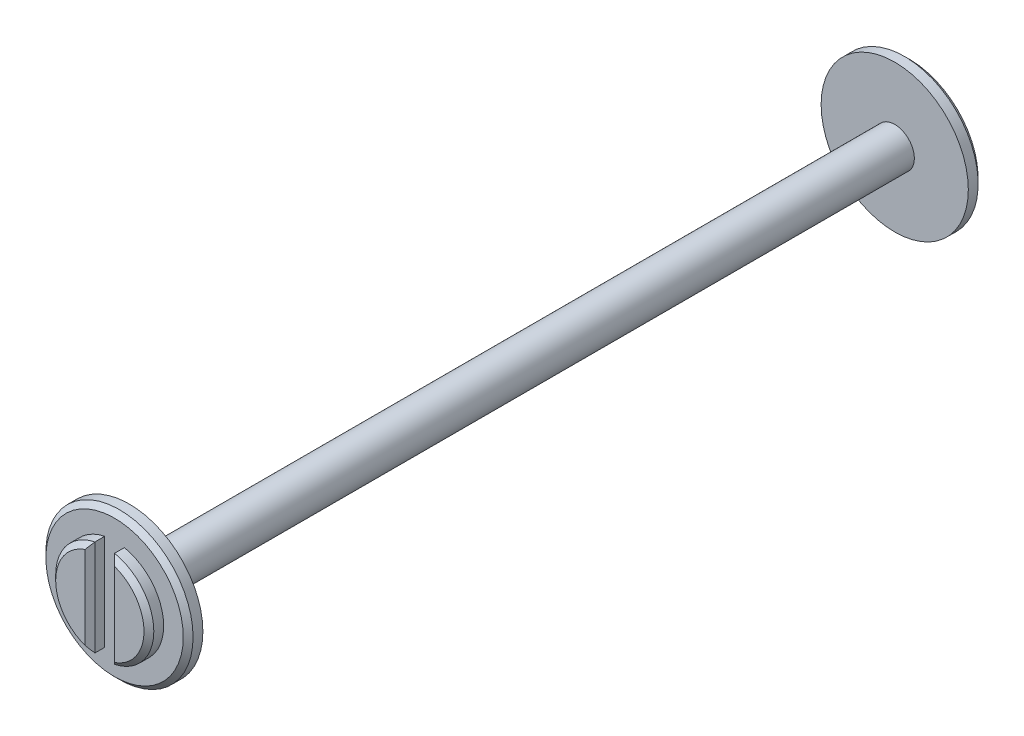
ISO-10303-21;
HEADER;
FILE_DESCRIPTION(('STEP AP214'),'2;1');
FILE_NAME('part.step','',(''),(''),'','','');
FILE_SCHEMA(('AUTOMOTIVE_DESIGN { 1 0 10303 214 1 1 1 1 }'));
ENDSEC;
DATA;
#1=APPLICATION_CONTEXT('core data for automotive mechanical design processes');
#2=APPLICATION_PROTOCOL_DEFINITION('international standard','automotive_design',2000,#1);
#3=PRODUCT_CONTEXT('',#1,'mechanical');
#4=PRODUCT('Part','Part','',(#3));
#5=PRODUCT_RELATED_PRODUCT_CATEGORY('part','',(#4));
#6=PRODUCT_DEFINITION_FORMATION('','',#4);
#7=PRODUCT_DEFINITION_CONTEXT('part definition',#1,'design');
#8=PRODUCT_DEFINITION('design','',#6,#7);
#9=PRODUCT_DEFINITION_SHAPE('','',#8);
#10=(LENGTH_UNIT() NAMED_UNIT(*) SI_UNIT(.MILLI.,.METRE.));
#11=(NAMED_UNIT(*) PLANE_ANGLE_UNIT() SI_UNIT($,.RADIAN.));
#12=(NAMED_UNIT(*) SI_UNIT($,.STERADIAN.) SOLID_ANGLE_UNIT());
#13=UNCERTAINTY_MEASURE_WITH_UNIT(LENGTH_MEASURE(1.E-05),#10,'distance_accuracy_value','');
#14=(GEOMETRIC_REPRESENTATION_CONTEXT(3) GLOBAL_UNCERTAINTY_ASSIGNED_CONTEXT((#13)) GLOBAL_UNIT_ASSIGNED_CONTEXT((#10,
#11,#12)) REPRESENTATION_CONTEXT('',''));
#15=CARTESIAN_POINT('',(0.,0.,0.));
#16=DIRECTION('',(0.,0.,1.));
#17=DIRECTION('',(1.,0.,0.));
#18=AXIS2_PLACEMENT_3D('',#15,#16,#17);
#19=CARTESIAN_POINT('',(0.,0.,3.));
#20=DIRECTION('',(0.,0.,-1.));
#21=DIRECTION('',(-1.,0.,0.));
#22=AXIS2_PLACEMENT_3D('',#19,#20,#21);
#23=CYLINDRICAL_SURFACE('',#22,5.);
#24=DIRECTION('',(0.,0.,-1.));
#25=VECTOR('',#24,1.);
#26=CARTESIAN_POINT('',(1.,4.89897948556636,3.));
#27=LINE('',#26,#25);
#28=CARTESIAN_POINT('',(1.,4.89897948556636,1.5));
#29=VERTEX_POINT('',#28);
#30=CARTESIAN_POINT('',(1.,4.89897948556636,2.49999999999999));
#31=VERTEX_POINT('',#30);
#32=EDGE_CURVE('E234',#29,#31,#27,.F.);
#33=ORIENTED_EDGE('',*,*,#32,.T.);
#34=CARTESIAN_POINT('',(0.,0.,2.49999999999999));
#35=DIRECTION('',(0.,0.,1.));
#36=DIRECTION('',(1.,0.,0.));
#37=AXIS2_PLACEMENT_3D('',#34,#35,#36);
#38=CIRCLE('',#37,5.);
#39=CARTESIAN_POINT('',(1.,-4.89897948556636,2.49999999999999));
#40=VERTEX_POINT('',#39);
#41=EDGE_CURVE('E299',#31,#40,#38,.F.);
#42=ORIENTED_EDGE('',*,*,#41,.T.);
#43=DIRECTION('',(0.,0.,-1.));
#44=VECTOR('',#43,1.);
#45=CARTESIAN_POINT('',(1.,-4.89897948556636,3.));
#46=LINE('',#45,#44);
#47=CARTESIAN_POINT('',(1.,-4.89897948556636,1.5));
#48=VERTEX_POINT('',#47);
#49=EDGE_CURVE('E237',#40,#48,#46,.T.);
#50=ORIENTED_EDGE('',*,*,#49,.T.);
#51=CARTESIAN_POINT('',(0.,0.,1.5));
#52=DIRECTION('',(0.,0.,1.));
#53=DIRECTION('',(1.,0.,0.));
#54=AXIS2_PLACEMENT_3D('',#51,#52,#53);
#55=CIRCLE('',#54,5.);
#56=EDGE_CURVE('E247',#48,#29,#55,.T.);
#57=ORIENTED_EDGE('',*,*,#56,.T.);
#58=EDGE_LOOP('',(#33,#42,#50,#57));
#59=FACE_BOUND('',#58,.T.);
#60=ADVANCED_FACE('F55',(#59),#23,.T.);
#61=CARTESIAN_POINT('',(0.,0.,3.));
#62=DIRECTION('',(0.,0.,1.));
#63=DIRECTION('',(1.,0.,0.));
#64=AXIS2_PLACEMENT_3D('',#61,#62,#63);
#65=PLANE('',#64);
#66=DIRECTION('',(0.,-1.,0.));
#67=VECTOR('',#66,1.);
#68=CARTESIAN_POINT('',(1.50000000000001,-4.89897948556636,3.));
#69=LINE('',#68,#67);
#70=CARTESIAN_POINT('',(1.50000000000001,4.24264068711927,3.));
#71=VERTEX_POINT('',#70);
#72=CARTESIAN_POINT('',(1.50000000000001,-4.24264068711927,3.));
#73=VERTEX_POINT('',#72);
#74=EDGE_CURVE('E292',#71,#73,#69,.T.);
#75=ORIENTED_EDGE('',*,*,#74,.T.);
#76=CARTESIAN_POINT('',(0.,0.,3.));
#77=DIRECTION('',(0.,0.,1.));
#78=DIRECTION('',(1.,0.,0.));
#79=AXIS2_PLACEMENT_3D('',#76,#77,#78);
#80=CIRCLE('',#79,4.49999999999999);
#81=EDGE_CURVE('E295',#73,#71,#80,.T.);
#82=ORIENTED_EDGE('',*,*,#81,.T.);
#83=EDGE_LOOP('',(#75,#82));
#84=FACE_BOUND('',#83,.T.);
#85=ADVANCED_FACE('F469',(#84),#65,.T.);
#86=CARTESIAN_POINT('',(0.,0.,1.5));
#87=DIRECTION('',(0.,0.,-1.));
#88=DIRECTION('',(-1.,0.,0.));
#89=AXIS2_PLACEMENT_3D('',#86,#87,#88);
#90=CYLINDRICAL_SURFACE('',#89,7.50000000000001);
#91=CARTESIAN_POINT('',(0.,0.,0.999999999999994));
#92=DIRECTION('',(0.,0.,1.));
#93=DIRECTION('',(1.,0.,0.));
#94=AXIS2_PLACEMENT_3D('',#91,#92,#93);
#95=CIRCLE('',#94,7.50000000000001);
#96=CARTESIAN_POINT('',(7.50000000000001,0.,0.999999999999994));
#97=VERTEX_POINT('',#96);
#98=EDGE_CURVE('E11',#97,#97,#95,.F.);
#99=ORIENTED_EDGE('',*,*,#98,.T.);
#100=EDGE_LOOP('',(#99));
#101=FACE_BOUND('',#100,.T.);
#102=CARTESIAN_POINT('',(0.,0.,0.));
#103=DIRECTION('',(0.,0.,1.));
#104=DIRECTION('',(1.,0.,0.));
#105=AXIS2_PLACEMENT_3D('',#102,#103,#104);
#106=CIRCLE('',#105,7.50000000000001);
#107=CARTESIAN_POINT('',(7.50000000000001,0.,0.));
#108=VERTEX_POINT('',#107);
#109=EDGE_CURVE('E240',#108,#108,#106,.T.);
#110=ORIENTED_EDGE('',*,*,#109,.T.);
#111=EDGE_LOOP('',(#110));
#112=FACE_BOUND('',#111,.T.);
#113=ADVANCED_FACE('F476',(#101,#112),#90,.T.);
#114=CARTESIAN_POINT('',(0.,0.,1.5));
#115=DIRECTION('',(0.,0.,1.));
#116=DIRECTION('',(1.,0.,0.));
#117=AXIS2_PLACEMENT_3D('',#114,#115,#116);
#118=PLANE('',#117);
#119=CARTESIAN_POINT('',(0.,0.,1.5));
#120=DIRECTION('',(0.,0.,1.));
#121=DIRECTION('',(1.,0.,0.));
#122=AXIS2_PLACEMENT_3D('',#119,#120,#121);
#123=CIRCLE('',#122,7.);
#124=CARTESIAN_POINT('',(7.,0.,1.5));
#125=VERTEX_POINT('',#124);
#126=EDGE_CURVE('E72',#125,#125,#123,.T.);
#127=ORIENTED_EDGE('',*,*,#126,.T.);
#128=EDGE_LOOP('',(#127));
#129=FACE_BOUND('',#128,.T.);
#130=ORIENTED_EDGE('',*,*,#56,.F.);
#131=DIRECTION('',(0.,1.,0.));
#132=VECTOR('',#131,1.);
#133=CARTESIAN_POINT('',(1.,-6.,1.5));
#134=LINE('',#133,#132);
#135=EDGE_CURVE('E209',#48,#29,#134,.T.);
#136=ORIENTED_EDGE('',*,*,#135,.T.);
#137=EDGE_LOOP('',(#130,#136));
#138=FACE_BOUND('',#137,.T.);
#139=CARTESIAN_POINT('',(-1.,4.89897948556636,1.5));
#140=VERTEX_POINT('',#139);
#141=CARTESIAN_POINT('',(-1.,-4.89897948556636,1.5));
#142=VERTEX_POINT('',#141);
#143=EDGE_CURVE('E246',#140,#142,#55,.T.);
#144=ORIENTED_EDGE('',*,*,#143,.F.);
#145=DIRECTION('',(0.,-1.,0.));
#146=VECTOR('',#145,1.);
#147=CARTESIAN_POINT('',(-1.,-6.,1.5));
#148=LINE('',#147,#146);
#149=EDGE_CURVE('E223',#140,#142,#148,.T.);
#150=ORIENTED_EDGE('',*,*,#149,.T.);
#151=EDGE_LOOP('',(#144,#150));
#152=FACE_BOUND('',#151,.T.);
#153=ADVANCED_FACE('F490',(#129,#138,#152),#118,.T.);
#154=CARTESIAN_POINT('',(0.,0.,0.));
#155=DIRECTION('',(0.,0.,1.));
#156=DIRECTION('',(1.,0.,0.));
#157=AXIS2_PLACEMENT_3D('',#154,#155,#156);
#158=PLANE('',#157);
#159=CARTESIAN_POINT('',(0.,0.,0.));
#160=DIRECTION('',(0.,0.,-1.));
#161=DIRECTION('',(-1.,0.,0.));
#162=AXIS2_PLACEMENT_3D('',#159,#160,#161);
#163=CIRCLE('',#162,2.);
#164=CARTESIAN_POINT('',(-2.,0.,0.));
#165=VERTEX_POINT('',#164);
#166=EDGE_CURVE('E241',#165,#165,#163,.T.);
#167=ORIENTED_EDGE('',*,*,#166,.F.);
#168=EDGE_LOOP('',(#167));
#169=FACE_BOUND('',#168,.T.);
#170=ORIENTED_EDGE('',*,*,#109,.F.);
#171=EDGE_LOOP('',(#170));
#172=FACE_BOUND('',#171,.T.);
#173=ADVANCED_FACE('F482',(#169,#172),#158,.F.);
#174=DIRECTION('',(0.,0.,-1.));
#175=VECTOR('',#174,1.);
#176=CARTESIAN_POINT('',(-1.,-4.89897948556636,3.));
#177=LINE('',#176,#175);
#178=CARTESIAN_POINT('',(-1.,-4.89897948556636,2.49999999999999));
#179=VERTEX_POINT('',#178);
#180=EDGE_CURVE('E227',#142,#179,#177,.F.);
#181=ORIENTED_EDGE('',*,*,#180,.T.);
#182=CARTESIAN_POINT('',(0.,0.,2.49999999999999));
#183=DIRECTION('',(0.,0.,1.));
#184=DIRECTION('',(1.,0.,0.));
#185=AXIS2_PLACEMENT_3D('',#182,#183,#184);
#186=CIRCLE('',#185,5.);
#187=CARTESIAN_POINT('',(-1.,4.89897948556636,2.49999999999999));
#188=VERTEX_POINT('',#187);
#189=EDGE_CURVE('E285',#179,#188,#186,.F.);
#190=ORIENTED_EDGE('',*,*,#189,.T.);
#191=DIRECTION('',(0.,0.,-1.));
#192=VECTOR('',#191,1.);
#193=CARTESIAN_POINT('',(-1.,4.89897948556636,3.));
#194=LINE('',#193,#192);
#195=EDGE_CURVE('E231',#188,#140,#194,.T.);
#196=ORIENTED_EDGE('',*,*,#195,.T.);
#197=ORIENTED_EDGE('',*,*,#143,.T.);
#198=EDGE_LOOP('',(#181,#190,#196,#197));
#199=FACE_BOUND('',#198,.T.);
#200=ADVANCED_FACE('F472',(#199),#23,.T.);
#201=DIRECTION('',(0.,1.,0.));
#202=VECTOR('',#201,1.);
#203=CARTESIAN_POINT('',(-1.50000000000001,4.89897948556636,3.));
#204=LINE('',#203,#202);
#205=CARTESIAN_POINT('',(-1.50000000000001,-4.24264068711928,3.));
#206=VERTEX_POINT('',#205);
#207=CARTESIAN_POINT('',(-1.50000000000001,4.24264068711928,3.));
#208=VERTEX_POINT('',#207);
#209=EDGE_CURVE('E278',#206,#208,#204,.T.);
#210=ORIENTED_EDGE('',*,*,#209,.T.);
#211=CARTESIAN_POINT('',(0.,0.,3.));
#212=DIRECTION('',(0.,0.,1.));
#213=DIRECTION('',(1.,0.,0.));
#214=AXIS2_PLACEMENT_3D('',#211,#212,#213);
#215=CIRCLE('',#214,4.49999999999999);
#216=EDGE_CURVE('E281',#208,#206,#215,.T.);
#217=ORIENTED_EDGE('',*,*,#216,.T.);
#218=EDGE_LOOP('',(#210,#217));
#219=FACE_BOUND('',#218,.T.);
#220=ADVANCED_FACE('F479',(#219),#65,.T.);
#221=CARTESIAN_POINT('',(0.,0.,-39.));
#222=DIRECTION('',(0.,0.,1.));
#223=DIRECTION('',(1.,0.,0.));
#224=AXIS2_PLACEMENT_3D('',#221,#222,#223);
#225=CYLINDRICAL_SURFACE('',#224,2.);
#226=ORIENTED_EDGE('',*,*,#166,.T.);
#227=EDGE_LOOP('',(#226));
#228=FACE_BOUND('',#227,.T.);
#229=CARTESIAN_POINT('',(0.,0.,-78.));
#230=DIRECTION('',(0.,0.,-1.));
#231=DIRECTION('',(-1.,0.,0.));
#232=AXIS2_PLACEMENT_3D('',#229,#230,#231);
#233=CIRCLE('',#232,2.);
#234=CARTESIAN_POINT('',(-2.,0.,-78.));
#235=VERTEX_POINT('',#234);
#236=EDGE_CURVE('E203',#235,#235,#233,.T.);
#237=ORIENTED_EDGE('',*,*,#236,.F.);
#238=EDGE_LOOP('',(#237));
#239=FACE_BOUND('',#238,.T.);
#240=ADVANCED_FACE('F488',(#228,#239),#225,.T.);
#241=CARTESIAN_POINT('',(1.,-6.,1.5));
#242=DIRECTION('',(1.,0.,0.));
#243=DIRECTION('',(0.,0.,-1.));
#244=AXIS2_PLACEMENT_3D('',#241,#242,#243);
#245=PLANE('',#244);
#246=ORIENTED_EDGE('',*,*,#49,.F.);
#247=DIRECTION('',(0.,1.,0.));
#248=VECTOR('',#247,1.);
#249=CARTESIAN_POINT('',(1.,4.89897948556636,2.49999999999999));
#250=LINE('',#249,#248);
#251=EDGE_CURVE('E83',#40,#31,#250,.T.);
#252=ORIENTED_EDGE('',*,*,#251,.T.);
#253=ORIENTED_EDGE('',*,*,#32,.F.);
#254=ORIENTED_EDGE('',*,*,#135,.F.);
#255=EDGE_LOOP('',(#246,#252,#253,#254));
#256=FACE_BOUND('',#255,.T.);
#257=ADVANCED_FACE('F513',(#256),#245,.F.);
#258=CARTESIAN_POINT('',(-1.,-6.,1.5));
#259=DIRECTION('',(-1.,0.,0.));
#260=DIRECTION('',(0.,0.,1.));
#261=AXIS2_PLACEMENT_3D('',#258,#259,#260);
#262=PLANE('',#261);
#263=ORIENTED_EDGE('',*,*,#195,.F.);
#264=DIRECTION('',(0.,-1.,0.));
#265=VECTOR('',#264,1.);
#266=CARTESIAN_POINT('',(-1.,-4.89897948556636,2.49999999999999));
#267=LINE('',#266,#265);
#268=EDGE_CURVE('E289',#188,#179,#267,.T.);
#269=ORIENTED_EDGE('',*,*,#268,.T.);
#270=ORIENTED_EDGE('',*,*,#180,.F.);
#271=ORIENTED_EDGE('',*,*,#149,.F.);
#272=EDGE_LOOP('',(#263,#269,#270,#271));
#273=FACE_BOUND('',#272,.T.);
#274=ADVANCED_FACE('F463',(#273),#262,.F.);
#275=CARTESIAN_POINT('',(0.,0.,-81.));
#276=DIRECTION('',(0.,0.,1.));
#277=DIRECTION('',(-1.,0.,0.));
#278=AXIS2_PLACEMENT_3D('',#275,#276,#277);
#279=CYLINDRICAL_SURFACE('',#278,5.);
#280=DIRECTION('',(0.,0.,1.));
#281=VECTOR('',#280,1.);
#282=CARTESIAN_POINT('',(1.,-4.89897948556636,-81.));
#283=LINE('',#282,#281);
#284=CARTESIAN_POINT('',(1.,-4.89897948556636,-80.5));
#285=VERTEX_POINT('',#284);
#286=CARTESIAN_POINT('',(1.,-4.89897948556636,-79.5));
#287=VERTEX_POINT('',#286);
#288=EDGE_CURVE('E219',#285,#287,#283,.T.);
#289=ORIENTED_EDGE('',*,*,#288,.F.);
#290=CARTESIAN_POINT('',(0.,0.,-80.5));
#291=DIRECTION('',(0.,0.,-1.));
#292=DIRECTION('',(-1.,0.,0.));
#293=AXIS2_PLACEMENT_3D('',#290,#291,#292);
#294=CIRCLE('',#293,5.);
#295=CARTESIAN_POINT('',(1.,4.89897948556636,-80.5));
#296=VERTEX_POINT('',#295);
#297=EDGE_CURVE('E245',#285,#296,#294,.F.);
#298=ORIENTED_EDGE('',*,*,#297,.T.);
#299=DIRECTION('',(0.,0.,1.));
#300=VECTOR('',#299,1.);
#301=CARTESIAN_POINT('',(1.,4.89897948556636,-81.));
#302=LINE('',#301,#300);
#303=CARTESIAN_POINT('',(1.,4.89897948556636,-79.5));
#304=VERTEX_POINT('',#303);
#305=EDGE_CURVE('E192',#304,#296,#302,.F.);
#306=ORIENTED_EDGE('',*,*,#305,.F.);
#307=CARTESIAN_POINT('',(0.,0.,-79.5));
#308=DIRECTION('',(0.,0.,1.));
#309=DIRECTION('',(1.,0.,0.));
#310=AXIS2_PLACEMENT_3D('',#307,#308,#309);
#311=CIRCLE('',#310,5.);
#312=EDGE_CURVE('E204',#287,#304,#311,.T.);
#313=ORIENTED_EDGE('',*,*,#312,.F.);
#314=EDGE_LOOP('',(#289,#298,#306,#313));
#315=FACE_BOUND('',#314,.T.);
#316=ADVANCED_FACE('F445',(#315),#279,.T.);
#317=CARTESIAN_POINT('',(0.,0.,-81.));
#318=DIRECTION('',(0.,0.,-1.));
#319=DIRECTION('',(1.,0.,0.));
#320=AXIS2_PLACEMENT_3D('',#317,#318,#319);
#321=PLANE('',#320);
#322=DIRECTION('',(0.,1.,0.));
#323=VECTOR('',#322,1.);
#324=CARTESIAN_POINT('',(1.5,4.89897948556636,-81.));
#325=LINE('',#324,#323);
#326=CARTESIAN_POINT('',(1.5,-4.24264068711928,-81.));
#327=VERTEX_POINT('',#326);
#328=CARTESIAN_POINT('',(1.5,4.24264068711928,-81.));
#329=VERTEX_POINT('',#328);
#330=EDGE_CURVE('E257',#327,#329,#325,.T.);
#331=ORIENTED_EDGE('',*,*,#330,.T.);
#332=CARTESIAN_POINT('',(0.,0.,-81.));
#333=DIRECTION('',(0.,0.,-1.));
#334=DIRECTION('',(-1.,0.,0.));
#335=AXIS2_PLACEMENT_3D('',#332,#333,#334);
#336=CIRCLE('',#335,4.5);
#337=EDGE_CURVE('E259',#329,#327,#336,.T.);
#338=ORIENTED_EDGE('',*,*,#337,.T.);
#339=EDGE_LOOP('',(#331,#338));
#340=FACE_BOUND('',#339,.T.);
#341=ADVANCED_FACE('F452',(#340),#321,.T.);
#342=CARTESIAN_POINT('',(0.,0.,-79.5));
#343=DIRECTION('',(0.,0.,1.));
#344=DIRECTION('',(-1.,0.,0.));
#345=AXIS2_PLACEMENT_3D('',#342,#343,#344);
#346=CYLINDRICAL_SURFACE('',#345,7.50000000000001);
#347=CARTESIAN_POINT('',(0.,0.,-79.));
#348=DIRECTION('',(0.,0.,-1.));
#349=DIRECTION('',(-1.,0.,0.));
#350=AXIS2_PLACEMENT_3D('',#347,#348,#349);
#351=CIRCLE('',#350,7.50000000000001);
#352=CARTESIAN_POINT('',(-7.50000000000001,0.,-79.));
#353=VERTEX_POINT('',#352);
#354=EDGE_CURVE('E305',#353,#353,#351,.F.);
#355=ORIENTED_EDGE('',*,*,#354,.T.);
#356=EDGE_LOOP('',(#355));
#357=FACE_BOUND('',#356,.T.);
#358=CARTESIAN_POINT('',(0.,0.,-78.));
#359=DIRECTION('',(0.,0.,1.));
#360=DIRECTION('',(1.,0.,0.));
#361=AXIS2_PLACEMENT_3D('',#358,#359,#360);
#362=CIRCLE('',#361,7.50000000000001);
#363=CARTESIAN_POINT('',(7.50000000000001,0.,-78.));
#364=VERTEX_POINT('',#363);
#365=EDGE_CURVE('E213',#364,#364,#362,.T.);
#366=ORIENTED_EDGE('',*,*,#365,.F.);
#367=EDGE_LOOP('',(#366));
#368=FACE_BOUND('',#367,.T.);
#369=ADVANCED_FACE('F454',(#357,#368),#346,.T.);
#370=CARTESIAN_POINT('',(0.,0.,-79.5));
#371=DIRECTION('',(0.,0.,-1.));
#372=DIRECTION('',(1.,0.,0.));
#373=AXIS2_PLACEMENT_3D('',#370,#371,#372);
#374=PLANE('',#373);
#375=CARTESIAN_POINT('',(0.,0.,-79.5));
#376=DIRECTION('',(0.,0.,-1.));
#377=DIRECTION('',(-1.,0.,0.));
#378=AXIS2_PLACEMENT_3D('',#375,#376,#377);
#379=CIRCLE('',#378,7.00000000000001);
#380=CARTESIAN_POINT('',(-7.00000000000001,0.,-79.5));
#381=VERTEX_POINT('',#380);
#382=EDGE_CURVE('E309',#381,#381,#379,.T.);
#383=ORIENTED_EDGE('',*,*,#382,.T.);
#384=EDGE_LOOP('',(#383));
#385=FACE_BOUND('',#384,.T.);
#386=ORIENTED_EDGE('',*,*,#312,.T.);
#387=DIRECTION('',(0.,1.,0.));
#388=VECTOR('',#387,1.);
#389=CARTESIAN_POINT('',(1.,-6.,-79.5));
#390=LINE('',#389,#388);
#391=EDGE_CURVE('E199',#287,#304,#390,.T.);
#392=ORIENTED_EDGE('',*,*,#391,.F.);
#393=EDGE_LOOP('',(#386,#392));
#394=FACE_BOUND('',#393,.T.);
#395=CARTESIAN_POINT('',(-1.,4.89897948556636,-79.5));
#396=VERTEX_POINT('',#395);
#397=CARTESIAN_POINT('',(-1.,-4.89897948556636,-79.5));
#398=VERTEX_POINT('',#397);
#399=EDGE_CURVE('E197',#396,#398,#311,.T.);
#400=ORIENTED_EDGE('',*,*,#399,.T.);
#401=DIRECTION('',(0.,-1.,0.));
#402=VECTOR('',#401,1.);
#403=CARTESIAN_POINT('',(-1.,-6.,-79.5));
#404=LINE('',#403,#402);
#405=EDGE_CURVE('E183',#396,#398,#404,.T.);
#406=ORIENTED_EDGE('',*,*,#405,.F.);
#407=EDGE_LOOP('',(#400,#406));
#408=FACE_BOUND('',#407,.T.);
#409=ADVANCED_FACE('F196',(#385,#394,#408),#374,.T.);
#410=CARTESIAN_POINT('',(0.,0.,-78.));
#411=DIRECTION('',(0.,0.,-1.));
#412=DIRECTION('',(1.,0.,0.));
#413=AXIS2_PLACEMENT_3D('',#410,#411,#412);
#414=PLANE('',#413);
#415=ORIENTED_EDGE('',*,*,#236,.T.);
#416=EDGE_LOOP('',(#415));
#417=FACE_BOUND('',#416,.T.);
#418=ORIENTED_EDGE('',*,*,#365,.T.);
#419=EDGE_LOOP('',(#418));
#420=FACE_BOUND('',#419,.T.);
#421=ADVANCED_FACE('F524',(#417,#420),#414,.F.);
#422=DIRECTION('',(0.,0.,1.));
#423=VECTOR('',#422,1.);
#424=CARTESIAN_POINT('',(-1.,4.89897948556636,-81.));
#425=LINE('',#424,#423);
#426=CARTESIAN_POINT('',(-1.,4.89897948556636,-80.5));
#427=VERTEX_POINT('',#426);
#428=EDGE_CURVE('E179',#427,#396,#425,.T.);
#429=ORIENTED_EDGE('',*,*,#428,.F.);
#430=CARTESIAN_POINT('',(0.,0.,-80.5));
#431=DIRECTION('',(0.,0.,-1.));
#432=DIRECTION('',(-1.,0.,0.));
#433=AXIS2_PLACEMENT_3D('',#430,#431,#432);
#434=CIRCLE('',#433,5.);
#435=CARTESIAN_POINT('',(-1.,-4.89897948556636,-80.5));
#436=VERTEX_POINT('',#435);
#437=EDGE_CURVE('E266',#427,#436,#434,.F.);
#438=ORIENTED_EDGE('',*,*,#437,.T.);
#439=DIRECTION('',(0.,0.,1.));
#440=VECTOR('',#439,1.);
#441=CARTESIAN_POINT('',(-1.,-4.89897948556636,-81.));
#442=LINE('',#441,#440);
#443=EDGE_CURVE('E193',#398,#436,#442,.F.);
#444=ORIENTED_EDGE('',*,*,#443,.F.);
#445=ORIENTED_EDGE('',*,*,#399,.F.);
#446=EDGE_LOOP('',(#429,#438,#444,#445));
#447=FACE_BOUND('',#446,.T.);
#448=ADVANCED_FACE('F201',(#447),#279,.T.);
#449=DIRECTION('',(0.,-1.,0.));
#450=VECTOR('',#449,1.);
#451=CARTESIAN_POINT('',(-1.5,-4.89897948556636,-81.));
#452=LINE('',#451,#450);
#453=CARTESIAN_POINT('',(-1.5,4.24264068711928,-81.));
#454=VERTEX_POINT('',#453);
#455=CARTESIAN_POINT('',(-1.5,-4.24264068711928,-81.));
#456=VERTEX_POINT('',#455);
#457=EDGE_CURVE('E269',#454,#456,#452,.T.);
#458=ORIENTED_EDGE('',*,*,#457,.T.);
#459=CARTESIAN_POINT('',(0.,0.,-81.));
#460=DIRECTION('',(0.,0.,-1.));
#461=DIRECTION('',(-1.,0.,0.));
#462=AXIS2_PLACEMENT_3D('',#459,#460,#461);
#463=CIRCLE('',#462,4.5);
#464=EDGE_CURVE('E272',#456,#454,#463,.T.);
#465=ORIENTED_EDGE('',*,*,#464,.T.);
#466=EDGE_LOOP('',(#458,#465));
#467=FACE_BOUND('',#466,.T.);
#468=ADVANCED_FACE('F456',(#467),#321,.T.);
#469=CARTESIAN_POINT('',(1.,-6.,-79.5));
#470=DIRECTION('',(1.,0.,0.));
#471=DIRECTION('',(0.,0.,1.));
#472=AXIS2_PLACEMENT_3D('',#469,#470,#471);
#473=PLANE('',#472);
#474=ORIENTED_EDGE('',*,*,#305,.T.);
#475=DIRECTION('',(0.,-1.,0.));
#476=VECTOR('',#475,1.);
#477=CARTESIAN_POINT('',(1.,-4.89897948556636,-80.5));
#478=LINE('',#477,#476);
#479=EDGE_CURVE('E263',#296,#285,#478,.T.);
#480=ORIENTED_EDGE('',*,*,#479,.T.);
#481=ORIENTED_EDGE('',*,*,#288,.T.);
#482=ORIENTED_EDGE('',*,*,#391,.T.);
#483=EDGE_LOOP('',(#474,#480,#481,#482));
#484=FACE_BOUND('',#483,.T.);
#485=ADVANCED_FACE('F437',(#484),#473,.F.);
#486=CARTESIAN_POINT('',(-1.,-6.,-79.5));
#487=DIRECTION('',(-1.,0.,0.));
#488=DIRECTION('',(0.,0.,-1.));
#489=AXIS2_PLACEMENT_3D('',#486,#487,#488);
#490=PLANE('',#489);
#491=ORIENTED_EDGE('',*,*,#443,.T.);
#492=DIRECTION('',(0.,1.,0.));
#493=VECTOR('',#492,1.);
#494=CARTESIAN_POINT('',(-1.,4.89897948556636,-80.5));
#495=LINE('',#494,#493);
#496=EDGE_CURVE('E186',#436,#427,#495,.T.);
#497=ORIENTED_EDGE('',*,*,#496,.T.);
#498=ORIENTED_EDGE('',*,*,#428,.T.);
#499=ORIENTED_EDGE('',*,*,#405,.T.);
#500=EDGE_LOOP('',(#491,#497,#498,#499));
#501=FACE_BOUND('',#500,.T.);
#502=ADVANCED_FACE('F182',(#501),#490,.F.);
#503=CARTESIAN_POINT('',(1.5,0.,-81.));
#504=DIRECTION('',(-0.707106781186538,0.,-0.707106781186557));
#505=DIRECTION('',(0.,-1.,0.));
#506=AXIS2_PLACEMENT_3D('',#503,#504,#505);
#507=PLANE('',#506);
#508=CARTESIAN_POINT('',(1.,4.89897948556636,-80.5));
#509=CARTESIAN_POINT('',(1.04298851007072,4.84632830615107,-80.5429885100707));
#510=CARTESIAN_POINT('',(1.08568156340757,4.79319263761821,-80.5856815634076));
#511=CARTESIAN_POINT('',(1.17041376641095,4.68592715736333,-80.670413766411));
#512=CARTESIAN_POINT('',(1.21245312103353,4.63179766933725,-80.7124531210335));
#513=CARTESIAN_POINT('',(1.29584431652666,4.52248337826971,-80.7958443165267));
#514=CARTESIAN_POINT('',(1.33719612774641,4.4672985299346,-80.8371961277464));
#515=CARTESIAN_POINT('',(1.41916620366947,4.35581339547519,-80.9191662036695));
#516=CARTESIAN_POINT('',(1.45978422918799,4.2995127577555,-80.959784229188));
#517=CARTESIAN_POINT('',(1.50000000000001,4.24264068711931,-81.));
#518=B_SPLINE_CURVE_WITH_KNOTS('',3,(#508,#509,#510,#511,#512,#513,#514,#515,#516,#517),
.UNSPECIFIED.,.F.,.F.,(4,2,2,2,4),(0.,0.241274171002205,0.48247110398799,0.723678411929173,
0.964962974594368),.UNSPECIFIED.);
#519=EDGE_CURVE('E316',#329,#296,#518,.F.);
#520=ORIENTED_EDGE('',*,*,#519,.F.);
#521=ORIENTED_EDGE('',*,*,#330,.F.);
#522=CARTESIAN_POINT('',(1.5,-4.24264068711928,-81.));
#523=CARTESIAN_POINT('',(1.45978422918799,-4.29951275775549,-80.959784229188));
#524=CARTESIAN_POINT('',(1.41916620366947,-4.35581339547519,-80.9191662036695));
#525=CARTESIAN_POINT('',(1.33719612774641,-4.4672985299346,-80.8371961277464));
#526=CARTESIAN_POINT('',(1.29584431652666,-4.52248337826971,-80.7958443165267));
#527=CARTESIAN_POINT('',(1.21245312103353,-4.63179766933725,-80.7124531210335));
#528=CARTESIAN_POINT('',(1.17041376641095,-4.68592715736333,-80.670413766411));
#529=CARTESIAN_POINT('',(1.08568156340757,-4.79319263761822,-80.5856815634076));
#530=CARTESIAN_POINT('',(1.04298851007072,-4.84632830615107,-80.5429885100707));
#531=CARTESIAN_POINT('',(0.999999999999997,-4.89897948556636,-80.5));
#532=B_SPLINE_CURVE_WITH_KNOTS('',3,(#522,#523,#524,#525,#526,#527,#528,#529,#530,#531),
.UNSPECIFIED.,.F.,.F.,(4,2,2,2,4),(0.,0.241284562665212,0.482491870606381,0.72368880359217,
0.964962974594378),.UNSPECIFIED.);
#533=EDGE_CURVE('E325',#285,#327,#532,.F.);
#534=ORIENTED_EDGE('',*,*,#533,.F.);
#535=ORIENTED_EDGE('',*,*,#479,.F.);
#536=EDGE_LOOP('',(#520,#521,#534,#535));
#537=FACE_BOUND('',#536,.T.);
#538=ADVANCED_FACE('F333',(#537),#507,.T.);
#539=CARTESIAN_POINT('',(0.,0.,-80.5));
#540=DIRECTION('',(0.,0.,1.));
#541=DIRECTION('',(1.,0.,0.));
#542=AXIS2_PLACEMENT_3D('',#539,#540,#541);
#543=CONICAL_SURFACE('',#542,5.,0.785398163397462);
#544=ORIENTED_EDGE('',*,*,#533,.T.);
#545=ORIENTED_EDGE('',*,*,#337,.F.);
#546=ORIENTED_EDGE('',*,*,#519,.T.);
#547=ORIENTED_EDGE('',*,*,#297,.F.);
#548=EDGE_LOOP('',(#544,#545,#546,#547));
#549=FACE_BOUND('',#548,.T.);
#550=ADVANCED_FACE('F337',(#549),#543,.T.);
#551=CARTESIAN_POINT('',(-1.5,0.,-81.));
#552=DIRECTION('',(0.707106781186538,0.,-0.707106781186557));
#553=DIRECTION('',(0.,1.,0.));
#554=AXIS2_PLACEMENT_3D('',#551,#552,#553);
#555=PLANE('',#554);
#556=CARTESIAN_POINT('',(-1.,-4.89897948556636,-80.5));
#557=CARTESIAN_POINT('',(-1.04298851007072,-4.84632830615107,-80.5429885100707));
#558=CARTESIAN_POINT('',(-1.08568156340757,-4.79319263761821,-80.5856815634076));
#559=CARTESIAN_POINT('',(-1.17041376641095,-4.68592715736333,-80.670413766411));
#560=CARTESIAN_POINT('',(-1.21245312103353,-4.63179766933725,-80.7124531210335));
#561=CARTESIAN_POINT('',(-1.29584431652666,-4.52248337826971,-80.7958443165267));
#562=CARTESIAN_POINT('',(-1.33719612774641,-4.4672985299346,-80.8371961277464));
#563=CARTESIAN_POINT('',(-1.41916620366947,-4.35581339547519,-80.9191662036695));
#564=CARTESIAN_POINT('',(-1.45978422918799,-4.2995127577555,-80.959784229188));
#565=CARTESIAN_POINT('',(-1.50000000000001,-4.24264068711931,-81.));
#566=B_SPLINE_CURVE_WITH_KNOTS('',3,(#556,#557,#558,#559,#560,#561,#562,#563,#564,#565),
.UNSPECIFIED.,.F.,.F.,(4,2,2,2,4),(0.,0.241274171002205,0.48247110398799,0.723678411929173,
0.964962974594368),.UNSPECIFIED.);
#567=EDGE_CURVE('E359',#456,#436,#566,.F.);
#568=ORIENTED_EDGE('',*,*,#567,.F.);
#569=ORIENTED_EDGE('',*,*,#457,.F.);
#570=CARTESIAN_POINT('',(-1.5,4.24264068711928,-81.));
#571=CARTESIAN_POINT('',(-1.45978422918799,4.29951275775549,-80.959784229188));
#572=CARTESIAN_POINT('',(-1.41916620366947,4.35581339547519,-80.9191662036695));
#573=CARTESIAN_POINT('',(-1.33719612774641,4.4672985299346,-80.8371961277464));
#574=CARTESIAN_POINT('',(-1.29584431652666,4.52248337826971,-80.7958443165267));
#575=CARTESIAN_POINT('',(-1.21245312103353,4.63179766933725,-80.7124531210335));
#576=CARTESIAN_POINT('',(-1.17041376641095,4.68592715736333,-80.670413766411));
#577=CARTESIAN_POINT('',(-1.08568156340757,4.79319263761822,-80.5856815634076));
#578=CARTESIAN_POINT('',(-1.04298851007072,4.84632830615107,-80.5429885100707));
#579=CARTESIAN_POINT('',(-0.999999999999996,4.89897948556636,-80.5));
#580=B_SPLINE_CURVE_WITH_KNOTS('',3,(#570,#571,#572,#573,#574,#575,#576,#577,#578,#579),
.UNSPECIFIED.,.F.,.F.,(4,2,2,2,4),(0.,0.241284562665212,0.482491870606381,0.723688803592171,
0.964962974594378),.UNSPECIFIED.);
#581=EDGE_CURVE('E326',#427,#454,#580,.F.);
#582=ORIENTED_EDGE('',*,*,#581,.F.);
#583=ORIENTED_EDGE('',*,*,#496,.F.);
#584=EDGE_LOOP('',(#568,#569,#582,#583));
#585=FACE_BOUND('',#584,.T.);
#586=ADVANCED_FACE('F343',(#585),#555,.T.);
#587=CARTESIAN_POINT('',(0.,0.,-80.5));
#588=DIRECTION('',(0.,0.,1.));
#589=DIRECTION('',(1.,0.,0.));
#590=AXIS2_PLACEMENT_3D('',#587,#588,#589);
#591=CONICAL_SURFACE('',#590,5.,0.785398163397462);
#592=ORIENTED_EDGE('',*,*,#581,.T.);
#593=ORIENTED_EDGE('',*,*,#464,.F.);
#594=ORIENTED_EDGE('',*,*,#567,.T.);
#595=ORIENTED_EDGE('',*,*,#437,.F.);
#596=EDGE_LOOP('',(#592,#593,#594,#595));
#597=FACE_BOUND('',#596,.T.);
#598=ADVANCED_FACE('F354',(#597),#591,.T.);
#599=CARTESIAN_POINT('',(-1.,-6.,2.49999999999999));
#600=DIRECTION('',(0.707106781186547,0.,0.707106781186547));
#601=DIRECTION('',(0.,1.,0.));
#602=AXIS2_PLACEMENT_3D('',#599,#600,#601);
#603=PLANE('',#602);
#604=CARTESIAN_POINT('',(-1.50000000000001,-4.24264068711928,3.));
#605=CARTESIAN_POINT('',(-1.459784229188,-4.29951275775548,2.95978422918799));
#606=CARTESIAN_POINT('',(-1.41916620366948,-4.35581339547518,2.91916620366947));
#607=CARTESIAN_POINT('',(-1.33719612774642,-4.46729852993459,2.83719612774641));
#608=CARTESIAN_POINT('',(-1.29584431652667,-4.5224833782697,2.79584431652666));
#609=CARTESIAN_POINT('',(-1.21245312103353,-4.63179766933724,2.71245312103352));
#610=CARTESIAN_POINT('',(-1.17041376641096,-4.68592715736332,2.67041376641095));
#611=CARTESIAN_POINT('',(-1.08568156340758,-4.79319263761821,2.58568156340757));
#612=CARTESIAN_POINT('',(-1.04298851007073,-4.84632830615106,2.54298851007072));
#613=CARTESIAN_POINT('',(-1.,-4.89897948556636,2.49999999999999));
#614=B_SPLINE_CURVE_WITH_KNOTS('',3,(#604,#605,#606,#607,#608,#609,#610,#611,#612,#613),
.UNSPECIFIED.,.F.,.F.,(4,2,2,2,4),(0.,0.241284562665206,0.482491870606391,0.723688803592174,
0.964962974594395),.UNSPECIFIED.);
#615=EDGE_CURVE('E371',#179,#206,#614,.F.);
#616=ORIENTED_EDGE('',*,*,#615,.F.);
#617=ORIENTED_EDGE('',*,*,#268,.F.);
#618=CARTESIAN_POINT('',(-1.,4.89897948556636,2.49999999999999));
#619=CARTESIAN_POINT('',(-1.04298851007073,4.84632830615106,2.54298851007072));
#620=CARTESIAN_POINT('',(-1.08568156340758,4.79319263761821,2.58568156340757));
#621=CARTESIAN_POINT('',(-1.17041376641096,4.68592715736332,2.67041376641095));
#622=CARTESIAN_POINT('',(-1.21245312103353,4.63179766933724,2.71245312103352));
#623=CARTESIAN_POINT('',(-1.29584431652667,4.5224833782697,2.79584431652666));
#624=CARTESIAN_POINT('',(-1.33719612774642,4.46729852993459,2.83719612774641));
#625=CARTESIAN_POINT('',(-1.41916620366948,4.35581339547518,2.91916620366947));
#626=CARTESIAN_POINT('',(-1.459784229188,4.29951275775549,2.959784229188));
#627=CARTESIAN_POINT('',(-1.50000000000002,4.2426406871193,3.00000000000001));
#628=B_SPLINE_CURVE_WITH_KNOTS('',3,(#618,#619,#620,#621,#622,#623,#624,#625,#626,#627),
.UNSPECIFIED.,.F.,.F.,(4,2,2,2,4),(0.,0.24127417100222,0.482471103988004,0.723678411929188,
0.964962974594393),.UNSPECIFIED.);
#629=EDGE_CURVE('E379',#208,#188,#628,.F.);
#630=ORIENTED_EDGE('',*,*,#629,.F.);
#631=ORIENTED_EDGE('',*,*,#209,.F.);
#632=EDGE_LOOP('',(#616,#617,#630,#631));
#633=FACE_BOUND('',#632,.T.);
#634=ADVANCED_FACE('F385',(#633),#603,.T.);
#635=CARTESIAN_POINT('',(0.,0.,3.));
#636=DIRECTION('',(0.,0.,-1.));
#637=DIRECTION('',(-1.,0.,0.));
#638=AXIS2_PLACEMENT_3D('',#635,#636,#637);
#639=CONICAL_SURFACE('',#638,4.49999999999999,0.785398163397448);
#640=ORIENTED_EDGE('',*,*,#629,.T.);
#641=ORIENTED_EDGE('',*,*,#189,.F.);
#642=ORIENTED_EDGE('',*,*,#615,.T.);
#643=ORIENTED_EDGE('',*,*,#216,.F.);
#644=EDGE_LOOP('',(#640,#641,#642,#643));
#645=FACE_BOUND('',#644,.T.);
#646=ADVANCED_FACE('F387',(#645),#639,.T.);
#647=CARTESIAN_POINT('',(1.,-6.,2.49999999999999));
#648=DIRECTION('',(-0.707106781186547,0.,0.707106781186547));
#649=DIRECTION('',(0.,-1.,0.));
#650=AXIS2_PLACEMENT_3D('',#647,#648,#649);
#651=PLANE('',#650);
#652=CARTESIAN_POINT('',(1.50000000000001,4.24264068711927,3.));
#653=CARTESIAN_POINT('',(1.459784229188,4.29951275775548,2.95978422918799));
#654=CARTESIAN_POINT('',(1.41916620366948,4.35581339547518,2.91916620366947));
#655=CARTESIAN_POINT('',(1.33719612774642,4.46729852993459,2.83719612774641));
#656=CARTESIAN_POINT('',(1.29584431652667,4.5224833782697,2.79584431652666));
#657=CARTESIAN_POINT('',(1.21245312103353,4.63179766933724,2.71245312103352));
#658=CARTESIAN_POINT('',(1.17041376641096,4.68592715736332,2.67041376641095));
#659=CARTESIAN_POINT('',(1.08568156340758,4.79319263761821,2.58568156340757));
#660=CARTESIAN_POINT('',(1.04298851007073,4.84632830615106,2.54298851007072));
#661=CARTESIAN_POINT('',(1.,4.89897948556636,2.49999999999999));
#662=B_SPLINE_CURVE_WITH_KNOTS('',3,(#652,#653,#654,#655,#656,#657,#658,#659,#660,#661),
.UNSPECIFIED.,.F.,.F.,(4,2,2,2,4),(0.,0.241284562665206,0.482491870606391,0.723688803592175,
0.964962974594396),.UNSPECIFIED.);
#663=EDGE_CURVE('E406',#31,#71,#662,.F.);
#664=ORIENTED_EDGE('',*,*,#663,.F.);
#665=ORIENTED_EDGE('',*,*,#251,.F.);
#666=CARTESIAN_POINT('',(1.,-4.89897948556636,2.49999999999999));
#667=CARTESIAN_POINT('',(1.04298851007073,-4.84632830615106,2.54298851007072));
#668=CARTESIAN_POINT('',(1.08568156340758,-4.79319263761821,2.58568156340757));
#669=CARTESIAN_POINT('',(1.17041376641096,-4.68592715736332,2.67041376641095));
#670=CARTESIAN_POINT('',(1.21245312103353,-4.63179766933724,2.71245312103352));
#671=CARTESIAN_POINT('',(1.29584431652667,-4.5224833782697,2.79584431652666));
#672=CARTESIAN_POINT('',(1.33719612774642,-4.46729852993459,2.83719612774641));
#673=CARTESIAN_POINT('',(1.41916620366948,-4.35581339547518,2.91916620366947));
#674=CARTESIAN_POINT('',(1.459784229188,-4.29951275775549,2.959784229188));
#675=CARTESIAN_POINT('',(1.50000000000002,-4.2426406871193,3.00000000000001));
#676=B_SPLINE_CURVE_WITH_KNOTS('',3,(#666,#667,#668,#669,#670,#671,#672,#673,#674,#675),
.UNSPECIFIED.,.F.,.F.,(4,2,2,2,4),(0.,0.24127417100222,0.482471103988005,0.723678411929188,
0.964962974594394),.UNSPECIFIED.);
#677=EDGE_CURVE('E60',#73,#40,#676,.F.);
#678=ORIENTED_EDGE('',*,*,#677,.F.);
#679=ORIENTED_EDGE('',*,*,#74,.F.);
#680=EDGE_LOOP('',(#664,#665,#678,#679));
#681=FACE_BOUND('',#680,.T.);
#682=ADVANCED_FACE('F392',(#681),#651,.T.);
#683=CARTESIAN_POINT('',(0.,0.,3.));
#684=DIRECTION('',(0.,0.,-1.));
#685=DIRECTION('',(-1.,0.,0.));
#686=AXIS2_PLACEMENT_3D('',#683,#684,#685);
#687=CONICAL_SURFACE('',#686,4.49999999999999,0.785398163397448);
#688=ORIENTED_EDGE('',*,*,#677,.T.);
#689=ORIENTED_EDGE('',*,*,#41,.F.);
#690=ORIENTED_EDGE('',*,*,#663,.T.);
#691=ORIENTED_EDGE('',*,*,#81,.F.);
#692=EDGE_LOOP('',(#688,#689,#690,#691));
#693=FACE_BOUND('',#692,.T.);
#694=ADVANCED_FACE('F402',(#693),#687,.T.);
#695=CARTESIAN_POINT('',(0.,0.,-79.));
#696=DIRECTION('',(0.,0.,1.));
#697=DIRECTION('',(1.,0.,0.));
#698=AXIS2_PLACEMENT_3D('',#695,#696,#697);
#699=CONICAL_SURFACE('',#698,7.50000000000001,0.785398163397456);
#700=ORIENTED_EDGE('',*,*,#382,.F.);
#701=EDGE_LOOP('',(#700));
#702=FACE_BOUND('',#701,.T.);
#703=ORIENTED_EDGE('',*,*,#354,.F.);
#704=EDGE_LOOP('',(#703));
#705=FACE_BOUND('',#704,.T.);
#706=ADVANCED_FACE('F587',(#702,#705),#699,.T.);
#707=CARTESIAN_POINT('',(0.,0.,1.5));
#708=DIRECTION('',(0.,0.,-1.));
#709=DIRECTION('',(-1.,0.,0.));
#710=AXIS2_PLACEMENT_3D('',#707,#708,#709);
#711=CONICAL_SURFACE('',#710,7.,0.78539816339745);
#712=ORIENTED_EDGE('',*,*,#98,.F.);
#713=EDGE_LOOP('',(#712));
#714=FACE_BOUND('',#713,.T.);
#715=ORIENTED_EDGE('',*,*,#126,.F.);
#716=EDGE_LOOP('',(#715));
#717=FACE_BOUND('',#716,.T.);
#718=ADVANCED_FACE('F58',(#714,#717),#711,.T.);
#719=CLOSED_SHELL('',(#60,#85,#113,#153,#173,#200,#220,#240,#257,#274,#316,#341,#369,#409,#421,
#448,#468,#485,#502,#538,#550,#586,#598,#634,#646,#682,#694,#706,#718));
#720=MANIFOLD_SOLID_BREP('B2',#719);
#721=ADVANCED_BREP_SHAPE_REPRESENTATION('',(#18,#720),#14);
#722=SHAPE_DEFINITION_REPRESENTATION(#9,#721);
ENDSEC;
END-ISO-10303-21;
